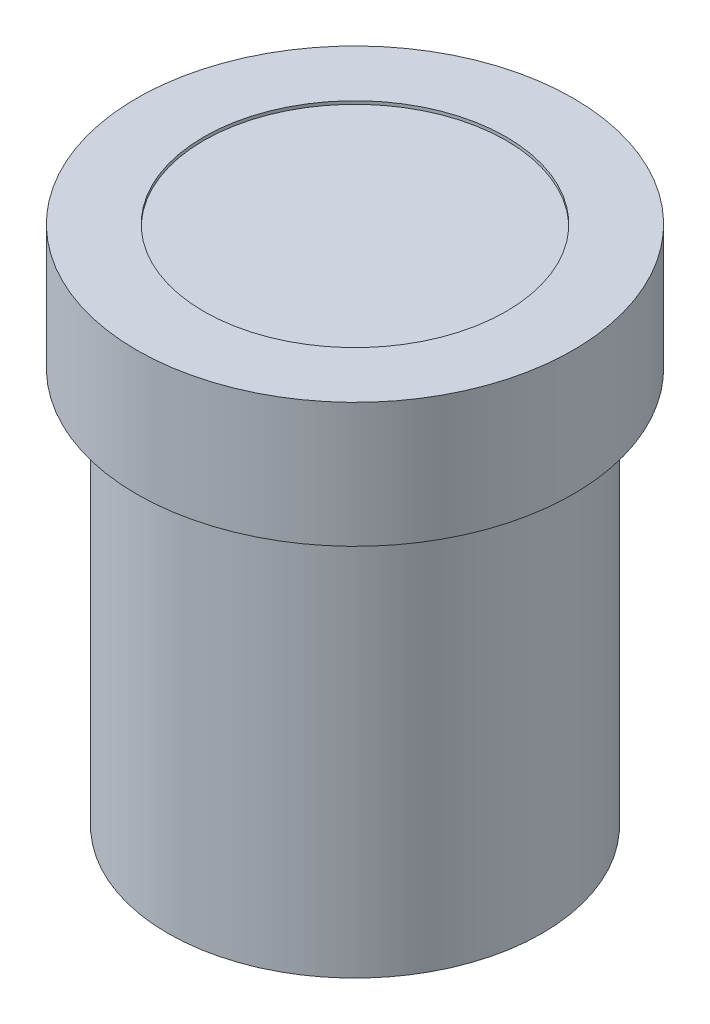
ISO-10303-21;
HEADER;
FILE_DESCRIPTION(('STEP AP214'),'2;1');
FILE_NAME('part.step','',(''),(''),'','','');
FILE_SCHEMA(('AUTOMOTIVE_DESIGN { 1 0 10303 214 1 1 1 1 }'));
ENDSEC;
DATA;
#1=APPLICATION_CONTEXT('core data for automotive mechanical design processes');
#2=APPLICATION_PROTOCOL_DEFINITION('international standard','automotive_design',2000,#1);
#3=PRODUCT_CONTEXT('',#1,'mechanical');
#4=PRODUCT('Part','Part','',(#3));
#5=PRODUCT_RELATED_PRODUCT_CATEGORY('part','',(#4));
#6=PRODUCT_DEFINITION_FORMATION('','',#4);
#7=PRODUCT_DEFINITION_CONTEXT('part definition',#1,'design');
#8=PRODUCT_DEFINITION('design','',#6,#7);
#9=PRODUCT_DEFINITION_SHAPE('','',#8);
#10=(LENGTH_UNIT() NAMED_UNIT(*) SI_UNIT(.MILLI.,.METRE.));
#11=(NAMED_UNIT(*) PLANE_ANGLE_UNIT() SI_UNIT($,.RADIAN.));
#12=(NAMED_UNIT(*) SI_UNIT($,.STERADIAN.) SOLID_ANGLE_UNIT());
#13=UNCERTAINTY_MEASURE_WITH_UNIT(LENGTH_MEASURE(1.E-05),#10,'distance_accuracy_value','');
#14=(GEOMETRIC_REPRESENTATION_CONTEXT(3) GLOBAL_UNCERTAINTY_ASSIGNED_CONTEXT((#13)) GLOBAL_UNIT_ASSIGNED_CONTEXT((#10,
#11,#12)) REPRESENTATION_CONTEXT('',''));
#15=CARTESIAN_POINT('',(0.,0.,0.));
#16=DIRECTION('',(0.,0.,1.));
#17=DIRECTION('',(1.,0.,0.));
#18=AXIS2_PLACEMENT_3D('',#15,#16,#17);
#19=CARTESIAN_POINT('',(0.,12.6,0.));
#20=DIRECTION('',(0.,1.,0.));
#21=DIRECTION('',(0.,0.,1.));
#22=AXIS2_PLACEMENT_3D('',#19,#20,#21);
#23=CYLINDRICAL_SURFACE('',#22,2.25);
#24=CARTESIAN_POINT('',(0.,12.6,0.));
#25=DIRECTION('',(0.,1.,0.));
#26=DIRECTION('',(0.,0.,1.));
#27=AXIS2_PLACEMENT_3D('',#24,#25,#26);
#28=CIRCLE('',#27,2.25);
#29=CARTESIAN_POINT('',(0.,12.6,2.25));
#30=VERTEX_POINT('',#29);
#31=EDGE_CURVE('E11',#30,#30,#28,.F.);
#32=ORIENTED_EDGE('',*,*,#31,.F.);
#33=EDGE_LOOP('',(#32));
#34=FACE_BOUND('',#33,.T.);
#35=CARTESIAN_POINT('',(0.,12.7,0.));
#36=DIRECTION('',(0.,1.,0.));
#37=DIRECTION('',(0.,0.,1.));
#38=AXIS2_PLACEMENT_3D('',#35,#36,#37);
#39=CIRCLE('',#38,2.25);
#40=CARTESIAN_POINT('',(0.,12.7,2.25));
#41=VERTEX_POINT('',#40);
#42=EDGE_CURVE('E49',#41,#41,#39,.F.);
#43=ORIENTED_EDGE('',*,*,#42,.T.);
#44=EDGE_LOOP('',(#43));
#45=FACE_BOUND('',#44,.T.);
#46=ADVANCED_FACE('F45',(#34,#45),#23,.T.);
#47=CARTESIAN_POINT('',(0.,12.6,0.));
#48=DIRECTION('',(0.,1.,0.));
#49=DIRECTION('',(0.,0.,1.));
#50=AXIS2_PLACEMENT_3D('',#47,#48,#49);
#51=PLANE('',#50);
#52=ORIENTED_EDGE('',*,*,#31,.T.);
#53=EDGE_LOOP('',(#52));
#54=FACE_BOUND('',#53,.T.);
#55=ADVANCED_FACE('F60',(#54),#51,.F.);
#56=CARTESIAN_POINT('',(0.,12.434375,0.));
#57=DIRECTION('',(0.,0.,1.));
#58=DIRECTION('',(1.,0.,0.));
#59=AXIS2_PLACEMENT_3D('',#56,#57,#58);
#60=SPHERICAL_SURFACE('',#59,2.265625);
#61=CARTESIAN_POINT('',(0.,12.434375,0.));
#62=DIRECTION('',(0.,1.,0.));
#63=DIRECTION('',(0.,0.,1.));
#64=AXIS2_PLACEMENT_3D('',#61,#62,#63);
#65=SPHERICAL_SURFACE('',#64,2.265625);
#66=ORIENTED_EDGE('',*,*,#42,.F.);
#67=EDGE_LOOP('',(#66));
#68=FACE_BOUND('',#67,.T.);
#69=ADVANCED_FACE('F47',(#68),#65,.T.);
#70=CLOSED_SHELL('',(#46,#55,#69));
#71=MANIFOLD_SOLID_BREP('B2',#70);
#72=CARTESIAN_POINT('',(0.,16.7,0.));
#73=DIRECTION('',(0.,-1.,0.));
#74=DIRECTION('',(0.,0.,-1.));
#75=AXIS2_PLACEMENT_3D('',#72,#73,#74);
#76=CYLINDRICAL_SURFACE('',#75,4.85);
#77=CARTESIAN_POINT('',(0.,12.7,0.));
#78=DIRECTION('',(0.,1.,0.));
#79=DIRECTION('',(0.,0.,1.));
#80=AXIS2_PLACEMENT_3D('',#77,#78,#79);
#81=CIRCLE('',#80,4.85);
#82=CARTESIAN_POINT('',(0.,12.7,4.85));
#83=VERTEX_POINT('',#82);
#84=EDGE_CURVE('E98',#83,#83,#81,.F.);
#85=ORIENTED_EDGE('',*,*,#84,.T.);
#86=EDGE_LOOP('',(#85));
#87=FACE_BOUND('',#86,.T.);
#88=CARTESIAN_POINT('',(0.,16.5,0.));
#89=DIRECTION('',(0.,1.,0.));
#90=DIRECTION('',(0.,0.,1.));
#91=AXIS2_PLACEMENT_3D('',#88,#89,#90);
#92=CIRCLE('',#91,4.85);
#93=CARTESIAN_POINT('',(0.,16.5,4.85));
#94=VERTEX_POINT('',#93);
#95=EDGE_CURVE('E122',#94,#94,#92,.T.);
#96=ORIENTED_EDGE('',*,*,#95,.T.);
#97=EDGE_LOOP('',(#96));
#98=FACE_BOUND('',#97,.T.);
#99=ADVANCED_FACE('F91',(#87,#98),#76,.F.);
#100=CARTESIAN_POINT('',(0.,12.7,0.));
#101=DIRECTION('',(0.,1.,0.));
#102=DIRECTION('',(0.,0.,1.));
#103=AXIS2_PLACEMENT_3D('',#100,#101,#102);
#104=PLANE('',#103);
#105=CARTESIAN_POINT('',(0.,12.7,0.));
#106=DIRECTION('',(0.,1.,0.));
#107=DIRECTION('',(0.,0.,1.));
#108=AXIS2_PLACEMENT_3D('',#105,#106,#107);
#109=CIRCLE('',#108,2.25);
#110=CARTESIAN_POINT('',(0.,12.7,2.25));
#111=VERTEX_POINT('',#110);
#112=EDGE_CURVE('E110',#111,#111,#109,.T.);
#113=ORIENTED_EDGE('',*,*,#112,.F.);
#114=EDGE_LOOP('',(#113));
#115=FACE_BOUND('',#114,.T.);
#116=ORIENTED_EDGE('',*,*,#84,.F.);
#117=EDGE_LOOP('',(#116));
#118=FACE_BOUND('',#117,.T.);
#119=ADVANCED_FACE('F141',(#115,#118),#104,.T.);
#120=CARTESIAN_POINT('',(0.,0.,0.));
#121=DIRECTION('',(0.,1.,0.));
#122=DIRECTION('',(0.,0.,1.));
#123=AXIS2_PLACEMENT_3D('',#120,#121,#122);
#124=PLANE('',#123);
#125=CARTESIAN_POINT('',(0.,0.,0.));
#126=DIRECTION('',(0.,1.,0.));
#127=DIRECTION('',(0.,0.,1.));
#128=AXIS2_PLACEMENT_3D('',#125,#126,#127);
#129=CIRCLE('',#128,6.);
#130=CARTESIAN_POINT('',(0.,0.,6.));
#131=VERTEX_POINT('',#130);
#132=EDGE_CURVE('E106',#131,#131,#129,.T.);
#133=ORIENTED_EDGE('',*,*,#132,.F.);
#134=EDGE_LOOP('',(#133));
#135=FACE_BOUND('',#134,.T.);
#136=CARTESIAN_POINT('',(0.,0.,0.));
#137=DIRECTION('',(0.,1.,0.));
#138=DIRECTION('',(0.,0.,1.));
#139=AXIS2_PLACEMENT_3D('',#136,#137,#138);
#140=CIRCLE('',#139,2.25);
#141=CARTESIAN_POINT('',(0.,0.,2.25));
#142=VERTEX_POINT('',#141);
#143=EDGE_CURVE('E112',#142,#142,#140,.T.);
#144=ORIENTED_EDGE('',*,*,#143,.T.);
#145=EDGE_LOOP('',(#144));
#146=FACE_BOUND('',#145,.T.);
#147=ADVANCED_FACE('F147',(#135,#146),#124,.F.);
#148=CARTESIAN_POINT('',(0.,12.7,0.));
#149=DIRECTION('',(0.,-1.,0.));
#150=DIRECTION('',(0.,0.,-1.));
#151=AXIS2_PLACEMENT_3D('',#148,#149,#150);
#152=CYLINDRICAL_SURFACE('',#151,6.);
#153=CARTESIAN_POINT('',(0.,12.7,0.));
#154=DIRECTION('',(0.,1.,0.));
#155=DIRECTION('',(0.,0.,1.));
#156=AXIS2_PLACEMENT_3D('',#153,#154,#155);
#157=CIRCLE('',#156,6.);
#158=CARTESIAN_POINT('',(0.,12.7,6.));
#159=VERTEX_POINT('',#158);
#160=EDGE_CURVE('E102',#159,#159,#157,.T.);
#161=ORIENTED_EDGE('',*,*,#160,.F.);
#162=EDGE_LOOP('',(#161));
#163=FACE_BOUND('',#162,.T.);
#164=ORIENTED_EDGE('',*,*,#132,.T.);
#165=EDGE_LOOP('',(#164));
#166=FACE_BOUND('',#165,.T.);
#167=ADVANCED_FACE('F93',(#163,#166),#152,.T.);
#168=CARTESIAN_POINT('',(0.,12.7,0.));
#169=DIRECTION('',(0.,-1.,0.));
#170=DIRECTION('',(0.,0.,-1.));
#171=AXIS2_PLACEMENT_3D('',#168,#169,#170);
#172=CYLINDRICAL_SURFACE('',#171,2.25);
#173=ORIENTED_EDGE('',*,*,#112,.T.);
#174=EDGE_LOOP('',(#173));
#175=FACE_BOUND('',#174,.T.);
#176=ORIENTED_EDGE('',*,*,#143,.F.);
#177=EDGE_LOOP('',(#176));
#178=FACE_BOUND('',#177,.T.);
#179=ADVANCED_FACE('F162',(#175,#178),#172,.F.);
#180=CARTESIAN_POINT('',(0.,16.7,0.));
#181=DIRECTION('',(0.,-1.,0.));
#182=DIRECTION('',(0.,0.,-1.));
#183=AXIS2_PLACEMENT_3D('',#180,#181,#182);
#184=CYLINDRICAL_SURFACE('',#183,7.);
#185=CARTESIAN_POINT('',(0.,16.7,0.));
#186=DIRECTION('',(0.,1.,0.));
#187=DIRECTION('',(0.,0.,1.));
#188=AXIS2_PLACEMENT_3D('',#185,#186,#187);
#189=CIRCLE('',#188,7.);
#190=CARTESIAN_POINT('',(0.,16.7,7.));
#191=VERTEX_POINT('',#190);
#192=EDGE_CURVE('E121',#191,#191,#189,.T.);
#193=ORIENTED_EDGE('',*,*,#192,.F.);
#194=EDGE_LOOP('',(#193));
#195=FACE_BOUND('',#194,.T.);
#196=CARTESIAN_POINT('',(0.,12.7,0.));
#197=DIRECTION('',(0.,1.,0.));
#198=DIRECTION('',(0.,0.,1.));
#199=AXIS2_PLACEMENT_3D('',#196,#197,#198);
#200=CIRCLE('',#199,7.);
#201=CARTESIAN_POINT('',(0.,12.7,7.));
#202=VERTEX_POINT('',#201);
#203=EDGE_CURVE('E118',#202,#202,#200,.T.);
#204=ORIENTED_EDGE('',*,*,#203,.T.);
#205=EDGE_LOOP('',(#204));
#206=FACE_BOUND('',#205,.T.);
#207=ADVANCED_FACE('F154',(#195,#206),#184,.T.);
#208=CARTESIAN_POINT('',(0.,16.6,0.));
#209=DIRECTION('',(0.,1.,0.));
#210=DIRECTION('',(0.,0.,1.));
#211=AXIS2_PLACEMENT_3D('',#208,#209,#210);
#212=CIRCLE('',#211,4.85);
#213=CARTESIAN_POINT('',(0.,16.6,4.85));
#214=VERTEX_POINT('',#213);
#215=EDGE_CURVE('E44',#214,#214,#212,.T.);
#216=ORIENTED_EDGE('',*,*,#215,.F.);
#217=EDGE_LOOP('',(#216));
#218=FACE_BOUND('',#217,.T.);
#219=CARTESIAN_POINT('',(0.,16.7,0.));
#220=DIRECTION('',(0.,1.,0.));
#221=DIRECTION('',(0.,0.,1.));
#222=AXIS2_PLACEMENT_3D('',#219,#220,#221);
#223=CIRCLE('',#222,4.85);
#224=CARTESIAN_POINT('',(0.,16.7,4.85));
#225=VERTEX_POINT('',#224);
#226=EDGE_CURVE('E115',#225,#225,#223,.T.);
#227=ORIENTED_EDGE('',*,*,#226,.T.);
#228=EDGE_LOOP('',(#227));
#229=FACE_BOUND('',#228,.T.);
#230=ADVANCED_FACE('F143',(#218,#229),#76,.F.);
#231=CARTESIAN_POINT('',(0.,16.7,0.));
#232=DIRECTION('',(0.,1.,0.));
#233=DIRECTION('',(0.,0.,1.));
#234=AXIS2_PLACEMENT_3D('',#231,#232,#233);
#235=PLANE('',#234);
#236=ORIENTED_EDGE('',*,*,#192,.T.);
#237=EDGE_LOOP('',(#236));
#238=FACE_BOUND('',#237,.T.);
#239=ORIENTED_EDGE('',*,*,#226,.F.);
#240=EDGE_LOOP('',(#239));
#241=FACE_BOUND('',#240,.T.);
#242=ADVANCED_FACE('F153',(#238,#241),#235,.T.);
#243=CARTESIAN_POINT('',(0.,12.7,0.));
#244=DIRECTION('',(0.,1.,0.));
#245=DIRECTION('',(0.,0.,1.));
#246=AXIS2_PLACEMENT_3D('',#243,#244,#245);
#247=PLANE('',#246);
#248=ORIENTED_EDGE('',*,*,#160,.T.);
#249=EDGE_LOOP('',(#248));
#250=FACE_BOUND('',#249,.T.);
#251=ORIENTED_EDGE('',*,*,#203,.F.);
#252=EDGE_LOOP('',(#251));
#253=FACE_BOUND('',#252,.T.);
#254=ADVANCED_FACE('F138',(#250,#253),#247,.F.);
#255=CARTESIAN_POINT('',(0.,16.6,0.));
#256=DIRECTION('',(0.,1.,0.));
#257=DIRECTION('',(0.,0.,1.));
#258=AXIS2_PLACEMENT_3D('',#255,#256,#257);
#259=PLANE('',#258);
#260=ORIENTED_EDGE('',*,*,#215,.T.);
#261=EDGE_LOOP('',(#260));
#262=FACE_BOUND('',#261,.T.);
#263=ADVANCED_FACE('F133',(#262),#259,.T.);
#264=CARTESIAN_POINT('',(0.,16.5,0.));
#265=DIRECTION('',(0.,1.,0.));
#266=DIRECTION('',(0.,0.,1.));
#267=AXIS2_PLACEMENT_3D('',#264,#265,#266);
#268=PLANE('',#267);
#269=ORIENTED_EDGE('',*,*,#95,.F.);
#270=EDGE_LOOP('',(#269));
#271=FACE_BOUND('',#270,.T.);
#272=ADVANCED_FACE('F131',(#271),#268,.F.);
#273=CLOSED_SHELL('',(#99,#119,#147,#167,#179,#207,#230,#242,#254,#263,#272));
#274=MANIFOLD_SOLID_BREP('B6',#273);
#275=ADVANCED_BREP_SHAPE_REPRESENTATION('',(#18,#71,#274),#14);
#276=SHAPE_DEFINITION_REPRESENTATION(#9,#275);
ENDSEC;
END-ISO-10303-21;
